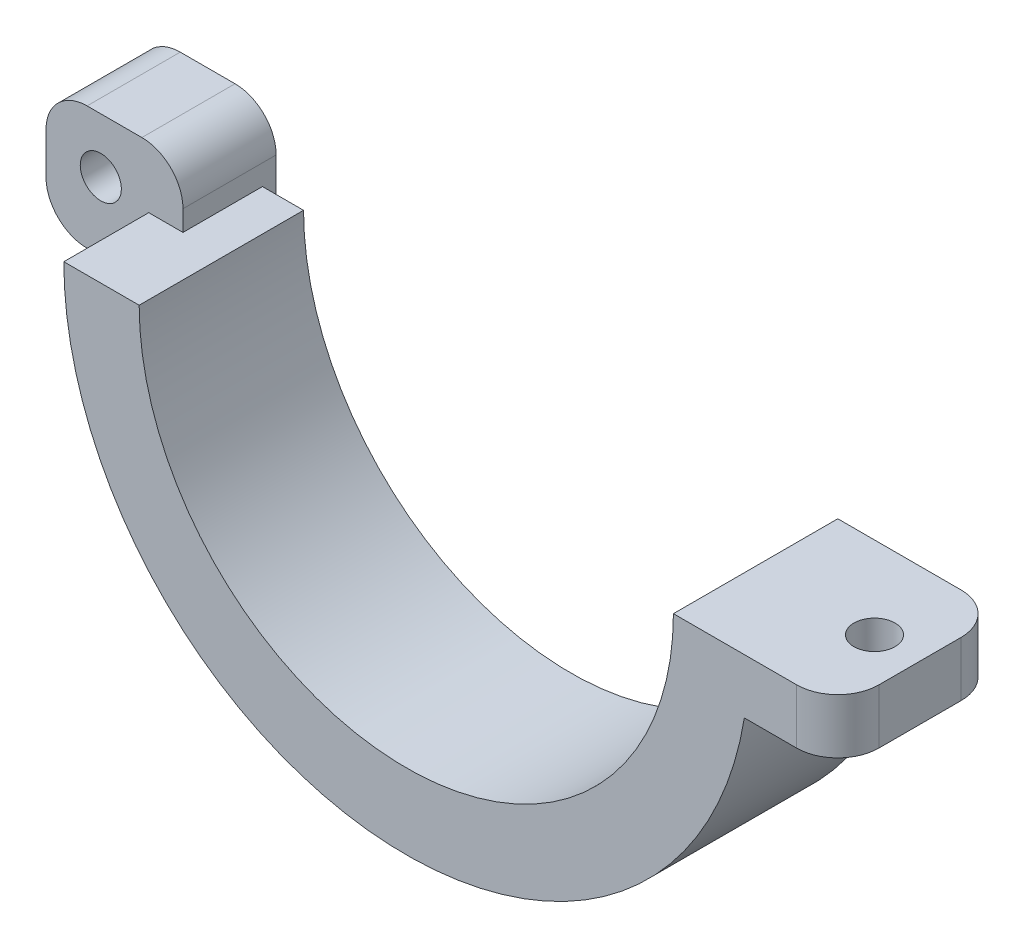
ISO-10303-21;
HEADER;
FILE_DESCRIPTION(('STEP AP214'),'2;1');
FILE_NAME('part.step','',(''),(''),'','','');
FILE_SCHEMA(('AUTOMOTIVE_DESIGN { 1 0 10303 214 1 1 1 1 }'));
ENDSEC;
DATA;
#1=APPLICATION_CONTEXT('core data for automotive mechanical design processes');
#2=APPLICATION_PROTOCOL_DEFINITION('international standard','automotive_design',2000,#1);
#3=PRODUCT_CONTEXT('',#1,'mechanical');
#4=PRODUCT('Part','Part','',(#3));
#5=PRODUCT_RELATED_PRODUCT_CATEGORY('part','',(#4));
#6=PRODUCT_DEFINITION_FORMATION('','',#4);
#7=PRODUCT_DEFINITION_CONTEXT('part definition',#1,'design');
#8=PRODUCT_DEFINITION('design','',#6,#7);
#9=PRODUCT_DEFINITION_SHAPE('','',#8);
#10=(LENGTH_UNIT() NAMED_UNIT(*) SI_UNIT(.MILLI.,.METRE.));
#11=(NAMED_UNIT(*) PLANE_ANGLE_UNIT() SI_UNIT($,.RADIAN.));
#12=(NAMED_UNIT(*) SI_UNIT($,.STERADIAN.) SOLID_ANGLE_UNIT());
#13=UNCERTAINTY_MEASURE_WITH_UNIT(LENGTH_MEASURE(1.E-05),#10,'distance_accuracy_value','');
#14=(GEOMETRIC_REPRESENTATION_CONTEXT(3) GLOBAL_UNCERTAINTY_ASSIGNED_CONTEXT((#13)) GLOBAL_UNIT_ASSIGNED_CONTEXT((#10,
#11,#12)) REPRESENTATION_CONTEXT('',''));
#15=CARTESIAN_POINT('',(0.,0.,0.));
#16=DIRECTION('',(0.,0.,1.));
#17=DIRECTION('',(1.,0.,0.));
#18=AXIS2_PLACEMENT_3D('',#15,#16,#17);
#19=CARTESIAN_POINT('',(28.5,0.,9.));
#20=DIRECTION('',(0.,1.,0.));
#21=DIRECTION('',(0.,0.,1.));
#22=AXIS2_PLACEMENT_3D('',#19,#20,#21);
#23=CYLINDRICAL_SURFACE('',#22,3.);
#24=DIRECTION('',(0.,1.,0.));
#25=VECTOR('',#24,1.);
#26=CARTESIAN_POINT('',(28.5,0.,12.));
#27=LINE('',#26,#25);
#28=CARTESIAN_POINT('',(28.5,-4.,12.));
#29=VERTEX_POINT('',#28);
#30=CARTESIAN_POINT('',(28.5,0.,12.));
#31=VERTEX_POINT('',#30);
#32=EDGE_CURVE('E281',#29,#31,#27,.T.);
#33=ORIENTED_EDGE('',*,*,#32,.F.);
#34=CARTESIAN_POINT('',(28.5,-4.,9.));
#35=DIRECTION('',(0.,-1.,0.));
#36=DIRECTION('',(0.,0.,-1.));
#37=AXIS2_PLACEMENT_3D('',#34,#35,#36);
#38=CIRCLE('',#37,3.);
#39=CARTESIAN_POINT('',(31.5,-4.,9.));
#40=VERTEX_POINT('',#39);
#41=EDGE_CURVE('E41',#40,#29,#38,.T.);
#42=ORIENTED_EDGE('',*,*,#41,.F.);
#43=DIRECTION('',(0.,1.,0.));
#44=VECTOR('',#43,1.);
#45=CARTESIAN_POINT('',(31.5,0.,9.));
#46=LINE('',#45,#44);
#47=CARTESIAN_POINT('',(31.5,0.,9.));
#48=VERTEX_POINT('',#47);
#49=EDGE_CURVE('E284',#48,#40,#46,.F.);
#50=ORIENTED_EDGE('',*,*,#49,.F.);
#51=CARTESIAN_POINT('',(28.5,0.,9.));
#52=DIRECTION('',(0.,1.,0.));
#53=DIRECTION('',(0.,0.,1.));
#54=AXIS2_PLACEMENT_3D('',#51,#52,#53);
#55=CIRCLE('',#54,3.);
#56=EDGE_CURVE('E11',#31,#48,#55,.T.);
#57=ORIENTED_EDGE('',*,*,#56,.F.);
#58=EDGE_LOOP('',(#33,#42,#50,#57));
#59=FACE_BOUND('',#58,.T.);
#60=ADVANCED_FACE('F34',(#59),#23,.T.);
#61=CARTESIAN_POINT('',(28.5,0.,3.));
#62=DIRECTION('',(0.,1.,0.));
#63=DIRECTION('',(0.,0.,1.));
#64=AXIS2_PLACEMENT_3D('',#61,#62,#63);
#65=CYLINDRICAL_SURFACE('',#64,3.);
#66=DIRECTION('',(0.,-1.,0.));
#67=VECTOR('',#66,1.);
#68=CARTESIAN_POINT('',(28.5,0.,0.));
#69=LINE('',#68,#67);
#70=CARTESIAN_POINT('',(28.5,0.,0.));
#71=VERTEX_POINT('',#70);
#72=CARTESIAN_POINT('',(28.5,-4.,0.));
#73=VERTEX_POINT('',#72);
#74=EDGE_CURVE('E270',#71,#73,#69,.T.);
#75=ORIENTED_EDGE('',*,*,#74,.F.);
#76=CARTESIAN_POINT('',(28.5,0.,3.));
#77=DIRECTION('',(0.,1.,0.));
#78=DIRECTION('',(0.,0.,1.));
#79=AXIS2_PLACEMENT_3D('',#76,#77,#78);
#80=CIRCLE('',#79,3.);
#81=CARTESIAN_POINT('',(31.5,0.,3.));
#82=VERTEX_POINT('',#81);
#83=EDGE_CURVE('E276',#82,#71,#80,.T.);
#84=ORIENTED_EDGE('',*,*,#83,.F.);
#85=DIRECTION('',(0.,-1.,0.));
#86=VECTOR('',#85,1.);
#87=CARTESIAN_POINT('',(31.5,0.,3.));
#88=LINE('',#87,#86);
#89=CARTESIAN_POINT('',(31.5,-4.,3.));
#90=VERTEX_POINT('',#89);
#91=EDGE_CURVE('E273',#90,#82,#88,.F.);
#92=ORIENTED_EDGE('',*,*,#91,.F.);
#93=CARTESIAN_POINT('',(28.5,-4.,3.));
#94=DIRECTION('',(0.,-1.,0.));
#95=DIRECTION('',(0.,0.,-1.));
#96=AXIS2_PLACEMENT_3D('',#93,#94,#95);
#97=CIRCLE('',#96,3.);
#98=EDGE_CURVE('E278',#73,#90,#97,.T.);
#99=ORIENTED_EDGE('',*,*,#98,.F.);
#100=EDGE_LOOP('',(#75,#84,#92,#99));
#101=FACE_BOUND('',#100,.T.);
#102=ADVANCED_FACE('F309',(#101),#65,.T.);
#103=CARTESIAN_POINT('',(-25.5,1.5,-1.));
#104=DIRECTION('',(0.,0.,-1.));
#105=DIRECTION('',(-1.,0.,0.));
#106=AXIS2_PLACEMENT_3D('',#103,#104,#105);
#107=CYLINDRICAL_SURFACE('',#106,3.);
#108=DIRECTION('',(0.,0.,-1.));
#109=VECTOR('',#108,1.);
#110=CARTESIAN_POINT('',(-25.5,4.5,-1.));
#111=LINE('',#110,#109);
#112=CARTESIAN_POINT('',(-25.5,4.5,5.8));
#113=VERTEX_POINT('',#112);
#114=CARTESIAN_POINT('',(-25.5,4.5,-1.));
#115=VERTEX_POINT('',#114);
#116=EDGE_CURVE('E262',#113,#115,#111,.T.);
#117=ORIENTED_EDGE('',*,*,#116,.F.);
#118=CARTESIAN_POINT('',(-25.5,1.5,5.8));
#119=DIRECTION('',(0.,0.,1.));
#120=DIRECTION('',(1.,0.,0.));
#121=AXIS2_PLACEMENT_3D('',#118,#119,#120);
#122=CIRCLE('',#121,3.);
#123=CARTESIAN_POINT('',(-22.5,1.5,5.8));
#124=VERTEX_POINT('',#123);
#125=EDGE_CURVE('E267',#124,#113,#122,.T.);
#126=ORIENTED_EDGE('',*,*,#125,.F.);
#127=DIRECTION('',(0.,0.,-1.));
#128=VECTOR('',#127,1.);
#129=CARTESIAN_POINT('',(-22.5,1.5,-1.));
#130=LINE('',#129,#128);
#131=CARTESIAN_POINT('',(-22.5,1.5,-1.));
#132=VERTEX_POINT('',#131);
#133=EDGE_CURVE('E265',#132,#124,#130,.F.);
#134=ORIENTED_EDGE('',*,*,#133,.F.);
#135=CARTESIAN_POINT('',(-25.5,1.5,-1.));
#136=DIRECTION('',(0.,0.,1.));
#137=DIRECTION('',(1.,0.,0.));
#138=AXIS2_PLACEMENT_3D('',#135,#136,#137);
#139=CIRCLE('',#138,3.);
#140=EDGE_CURVE('E154',#115,#132,#139,.F.);
#141=ORIENTED_EDGE('',*,*,#140,.F.);
#142=EDGE_LOOP('',(#117,#126,#134,#141));
#143=FACE_BOUND('',#142,.T.);
#144=ADVANCED_FACE('F349',(#143),#107,.T.);
#145=CARTESIAN_POINT('',(-29.5,1.5,-1.));
#146=DIRECTION('',(0.,0.,1.));
#147=DIRECTION('',(1.,0.,0.));
#148=AXIS2_PLACEMENT_3D('',#145,#146,#147);
#149=CYLINDRICAL_SURFACE('',#148,3.);
#150=DIRECTION('',(0.,0.,1.));
#151=VECTOR('',#150,1.);
#152=CARTESIAN_POINT('',(-29.5,4.5,-1.));
#153=LINE('',#152,#151);
#154=CARTESIAN_POINT('',(-29.5,4.5,-1.));
#155=VERTEX_POINT('',#154);
#156=CARTESIAN_POINT('',(-29.5,4.5,5.8));
#157=VERTEX_POINT('',#156);
#158=EDGE_CURVE('E252',#155,#157,#153,.T.);
#159=ORIENTED_EDGE('',*,*,#158,.F.);
#160=CARTESIAN_POINT('',(-29.5,1.5,-1.));
#161=DIRECTION('',(0.,0.,1.));
#162=DIRECTION('',(1.,0.,0.));
#163=AXIS2_PLACEMENT_3D('',#160,#161,#162);
#164=CIRCLE('',#163,3.);
#165=CARTESIAN_POINT('',(-32.5,1.5,-1.));
#166=VERTEX_POINT('',#165);
#167=EDGE_CURVE('E258',#166,#155,#164,.F.);
#168=ORIENTED_EDGE('',*,*,#167,.F.);
#169=DIRECTION('',(0.,0.,1.));
#170=VECTOR('',#169,1.);
#171=CARTESIAN_POINT('',(-32.5,1.5,-1.));
#172=LINE('',#171,#170);
#173=CARTESIAN_POINT('',(-32.5,1.5,5.8));
#174=VERTEX_POINT('',#173);
#175=EDGE_CURVE('E255',#174,#166,#172,.F.);
#176=ORIENTED_EDGE('',*,*,#175,.F.);
#177=CARTESIAN_POINT('',(-29.5,1.5,5.8));
#178=DIRECTION('',(0.,0.,1.));
#179=DIRECTION('',(1.,0.,0.));
#180=AXIS2_PLACEMENT_3D('',#177,#178,#179);
#181=CIRCLE('',#180,3.);
#182=EDGE_CURVE('E260',#157,#174,#181,.T.);
#183=ORIENTED_EDGE('',*,*,#182,.F.);
#184=EDGE_LOOP('',(#159,#168,#176,#183));
#185=FACE_BOUND('',#184,.T.);
#186=ADVANCED_FACE('F342',(#185),#149,.T.);
#187=CARTESIAN_POINT('',(-29.5,-1.5,-1.));
#188=DIRECTION('',(0.,0.,-1.));
#189=DIRECTION('',(-1.,0.,0.));
#190=AXIS2_PLACEMENT_3D('',#187,#188,#189);
#191=CYLINDRICAL_SURFACE('',#190,3.);
#192=DIRECTION('',(0.,0.,-1.));
#193=VECTOR('',#192,1.);
#194=CARTESIAN_POINT('',(-29.5,-4.5,-1.));
#195=LINE('',#194,#193);
#196=CARTESIAN_POINT('',(-29.5,-4.5,5.8));
#197=VERTEX_POINT('',#196);
#198=CARTESIAN_POINT('',(-29.5,-4.5,-1.));
#199=VERTEX_POINT('',#198);
#200=EDGE_CURVE('E169',#197,#199,#195,.T.);
#201=ORIENTED_EDGE('',*,*,#200,.F.);
#202=CARTESIAN_POINT('',(-29.5,-1.5,5.8));
#203=DIRECTION('',(0.,0.,1.));
#204=DIRECTION('',(1.,0.,0.));
#205=AXIS2_PLACEMENT_3D('',#202,#203,#204);
#206=CIRCLE('',#205,3.);
#207=CARTESIAN_POINT('',(-32.5,-1.5,5.8));
#208=VERTEX_POINT('',#207);
#209=EDGE_CURVE('E248',#208,#197,#206,.T.);
#210=ORIENTED_EDGE('',*,*,#209,.F.);
#211=DIRECTION('',(0.,0.,-1.));
#212=VECTOR('',#211,1.);
#213=CARTESIAN_POINT('',(-32.5,-1.5,-1.));
#214=LINE('',#213,#212);
#215=CARTESIAN_POINT('',(-32.5,-1.5,-1.));
#216=VERTEX_POINT('',#215);
#217=EDGE_CURVE('E245',#216,#208,#214,.F.);
#218=ORIENTED_EDGE('',*,*,#217,.F.);
#219=CARTESIAN_POINT('',(-29.5,-1.5,-1.));
#220=DIRECTION('',(0.,0.,1.));
#221=DIRECTION('',(1.,0.,0.));
#222=AXIS2_PLACEMENT_3D('',#219,#220,#221);
#223=CIRCLE('',#222,3.);
#224=EDGE_CURVE('E250',#199,#216,#223,.F.);
#225=ORIENTED_EDGE('',*,*,#224,.F.);
#226=EDGE_LOOP('',(#201,#210,#218,#225));
#227=FACE_BOUND('',#226,.T.);
#228=ADVANCED_FACE('F351',(#227),#191,.T.);
#229=CARTESIAN_POINT('',(0.,0.,12.));
#230=DIRECTION('',(0.,1.,0.));
#231=DIRECTION('',(0.,0.,1.));
#232=AXIS2_PLACEMENT_3D('',#229,#230,#231);
#233=PLANE('',#232);
#234=DIRECTION('',(1.,0.,0.));
#235=VECTOR('',#234,1.);
#236=CARTESIAN_POINT('',(0.,0.,0.));
#237=LINE('',#236,#235);
#238=CARTESIAN_POINT('',(-22.5,0.,0.));
#239=VERTEX_POINT('',#238);
#240=CARTESIAN_POINT('',(-19.5,0.,0.));
#241=VERTEX_POINT('',#240);
#242=EDGE_CURVE('E207',#239,#241,#237,.T.);
#243=ORIENTED_EDGE('',*,*,#242,.F.);
#244=DIRECTION('',(0.,0.,1.));
#245=VECTOR('',#244,1.);
#246=CARTESIAN_POINT('',(-22.5,0.,12.));
#247=LINE('',#246,#245);
#248=CARTESIAN_POINT('',(-22.5,0.,5.8));
#249=VERTEX_POINT('',#248);
#250=EDGE_CURVE('E180',#239,#249,#247,.T.);
#251=ORIENTED_EDGE('',*,*,#250,.T.);
#252=DIRECTION('',(1.,0.,0.));
#253=VECTOR('',#252,1.);
#254=CARTESIAN_POINT('',(0.,0.,5.8));
#255=LINE('',#254,#253);
#256=CARTESIAN_POINT('',(-25.,0.,5.8));
#257=VERTEX_POINT('',#256);
#258=EDGE_CURVE('E187',#257,#249,#255,.T.);
#259=ORIENTED_EDGE('',*,*,#258,.F.);
#260=DIRECTION('',(0.,0.,-1.));
#261=VECTOR('',#260,1.);
#262=CARTESIAN_POINT('',(-25.,0.,12.));
#263=LINE('',#262,#261);
#264=CARTESIAN_POINT('',(-25.,0.,12.));
#265=VERTEX_POINT('',#264);
#266=EDGE_CURVE('E231',#265,#257,#263,.T.);
#267=ORIENTED_EDGE('',*,*,#266,.F.);
#268=DIRECTION('',(1.,0.,0.));
#269=VECTOR('',#268,1.);
#270=CARTESIAN_POINT('',(0.,0.,12.));
#271=LINE('',#270,#269);
#272=CARTESIAN_POINT('',(-19.5,0.,12.));
#273=VERTEX_POINT('',#272);
#274=EDGE_CURVE('E208',#265,#273,#271,.T.);
#275=ORIENTED_EDGE('',*,*,#274,.T.);
#276=DIRECTION('',(0.,0.,-1.));
#277=VECTOR('',#276,1.);
#278=CARTESIAN_POINT('',(-19.5,0.,12.));
#279=LINE('',#278,#277);
#280=EDGE_CURVE('E219',#273,#241,#279,.T.);
#281=ORIENTED_EDGE('',*,*,#280,.T.);
#282=EDGE_LOOP('',(#243,#251,#259,#267,#275,#281));
#283=FACE_BOUND('',#282,.T.);
#284=ADVANCED_FACE('F319',(#283),#233,.T.);
#285=CARTESIAN_POINT('',(0.,0.,12.));
#286=DIRECTION('',(0.,0.,-1.));
#287=DIRECTION('',(-1.,0.,0.));
#288=AXIS2_PLACEMENT_3D('',#285,#286,#287);
#289=CYLINDRICAL_SURFACE('',#288,25.);
#290=DIRECTION('',(0.,0.,-1.));
#291=VECTOR('',#290,1.);
#292=CARTESIAN_POINT('',(-24.5916652547159,-4.5,12.));
#293=LINE('',#292,#291);
#294=CARTESIAN_POINT('',(-24.5916652547159,-4.5,0.));
#295=VERTEX_POINT('',#294);
#296=CARTESIAN_POINT('',(-24.5916652547159,-4.5,5.8));
#297=VERTEX_POINT('',#296);
#298=EDGE_CURVE('E176',#295,#297,#293,.F.);
#299=ORIENTED_EDGE('',*,*,#298,.F.);
#300=CARTESIAN_POINT('',(0.,0.,0.));
#301=DIRECTION('',(0.,0.,1.));
#302=DIRECTION('',(1.,0.,0.));
#303=AXIS2_PLACEMENT_3D('',#300,#301,#302);
#304=CIRCLE('',#303,25.);
#305=CARTESIAN_POINT('',(24.6779253585061,-4.,0.));
#306=VERTEX_POINT('',#305);
#307=EDGE_CURVE('E221',#295,#306,#304,.T.);
#308=ORIENTED_EDGE('',*,*,#307,.T.);
#309=DIRECTION('',(0.,0.,-1.));
#310=VECTOR('',#309,1.);
#311=CARTESIAN_POINT('',(24.6779253585061,-4.,12.));
#312=LINE('',#311,#310);
#313=CARTESIAN_POINT('',(24.6779253585061,-4.,12.));
#314=VERTEX_POINT('',#313);
#315=EDGE_CURVE('E203',#306,#314,#312,.F.);
#316=ORIENTED_EDGE('',*,*,#315,.T.);
#317=CARTESIAN_POINT('',(0.,0.,12.));
#318=DIRECTION('',(0.,0.,1.));
#319=DIRECTION('',(1.,0.,0.));
#320=AXIS2_PLACEMENT_3D('',#317,#318,#319);
#321=CIRCLE('',#320,25.);
#322=EDGE_CURVE('E211',#265,#314,#321,.T.);
#323=ORIENTED_EDGE('',*,*,#322,.F.);
#324=ORIENTED_EDGE('',*,*,#266,.T.);
#325=CARTESIAN_POINT('',(0.,0.,5.8));
#326=DIRECTION('',(0.,0.,1.));
#327=DIRECTION('',(1.,0.,0.));
#328=AXIS2_PLACEMENT_3D('',#325,#326,#327);
#329=CIRCLE('',#328,25.);
#330=EDGE_CURVE('E237',#257,#297,#329,.T.);
#331=ORIENTED_EDGE('',*,*,#330,.T.);
#332=EDGE_LOOP('',(#299,#308,#316,#323,#324,#331));
#333=FACE_BOUND('',#332,.T.);
#334=ADVANCED_FACE('F298',(#333),#289,.T.);
#335=CARTESIAN_POINT('',(0.,0.,0.));
#336=DIRECTION('',(0.,0.,1.));
#337=DIRECTION('',(1.,0.,0.));
#338=AXIS2_PLACEMENT_3D('',#335,#336,#337);
#339=PLANE('',#338);
#340=CARTESIAN_POINT('',(19.5,0.,0.));
#341=VERTEX_POINT('',#340);
#342=EDGE_CURVE('E222',#341,#71,#237,.T.);
#343=ORIENTED_EDGE('',*,*,#342,.T.);
#344=ORIENTED_EDGE('',*,*,#74,.T.);
#345=DIRECTION('',(-1.,0.,0.));
#346=VECTOR('',#345,1.);
#347=CARTESIAN_POINT('',(31.5,-4.,0.));
#348=LINE('',#347,#346);
#349=EDGE_CURVE('E196',#73,#306,#348,.T.);
#350=ORIENTED_EDGE('',*,*,#349,.T.);
#351=ORIENTED_EDGE('',*,*,#307,.F.);
#352=DIRECTION('',(-1.,0.,0.));
#353=VECTOR('',#352,1.);
#354=CARTESIAN_POINT('',(0.,-4.5,0.));
#355=LINE('',#354,#353);
#356=CARTESIAN_POINT('',(-22.5,-4.5,0.));
#357=VERTEX_POINT('',#356);
#358=EDGE_CURVE('E234',#357,#295,#355,.T.);
#359=ORIENTED_EDGE('',*,*,#358,.F.);
#360=DIRECTION('',(0.,-1.,0.));
#361=VECTOR('',#360,1.);
#362=CARTESIAN_POINT('',(-22.5,0.,0.));
#363=LINE('',#362,#361);
#364=EDGE_CURVE('E175',#239,#357,#363,.T.);
#365=ORIENTED_EDGE('',*,*,#364,.F.);
#366=ORIENTED_EDGE('',*,*,#242,.T.);
#367=CARTESIAN_POINT('',(0.,0.,0.));
#368=DIRECTION('',(0.,0.,1.));
#369=DIRECTION('',(1.,0.,0.));
#370=AXIS2_PLACEMENT_3D('',#367,#368,#369);
#371=CIRCLE('',#370,19.5);
#372=EDGE_CURVE('E212',#241,#341,#371,.T.);
#373=ORIENTED_EDGE('',*,*,#372,.T.);
#374=EDGE_LOOP('',(#343,#344,#350,#351,#359,#365,#366,#373));
#375=FACE_BOUND('',#374,.T.);
#376=ADVANCED_FACE('F304',(#375),#339,.F.);
#377=CARTESIAN_POINT('',(28.1779253585061,0.,6.));
#378=DIRECTION('',(0.,1.,0.));
#379=DIRECTION('',(0.,0.,1.));
#380=AXIS2_PLACEMENT_3D('',#377,#378,#379);
#381=CIRCLE('',#380,1.49999999999885);
#382=CARTESIAN_POINT('',(28.1779253585061,0.,7.49999999999885));
#383=VERTEX_POINT('',#382);
#384=EDGE_CURVE('E193',#383,#383,#381,.T.);
#385=ORIENTED_EDGE('',*,*,#384,.F.);
#386=EDGE_LOOP('',(#385));
#387=FACE_BOUND('',#386,.T.);
#388=CARTESIAN_POINT('',(19.5,0.,12.));
#389=VERTEX_POINT('',#388);
#390=EDGE_CURVE('E213',#389,#31,#271,.T.);
#391=ORIENTED_EDGE('',*,*,#390,.T.);
#392=ORIENTED_EDGE('',*,*,#56,.T.);
#393=DIRECTION('',(0.,0.,-1.));
#394=VECTOR('',#393,1.);
#395=CARTESIAN_POINT('',(31.5,0.,12.));
#396=LINE('',#395,#394);
#397=EDGE_CURVE('E201',#48,#82,#396,.T.);
#398=ORIENTED_EDGE('',*,*,#397,.T.);
#399=ORIENTED_EDGE('',*,*,#83,.T.);
#400=ORIENTED_EDGE('',*,*,#342,.F.);
#401=DIRECTION('',(0.,0.,-1.));
#402=VECTOR('',#401,1.);
#403=CARTESIAN_POINT('',(19.5,0.,12.));
#404=LINE('',#403,#402);
#405=EDGE_CURVE('E229',#389,#341,#404,.T.);
#406=ORIENTED_EDGE('',*,*,#405,.F.);
#407=EDGE_LOOP('',(#391,#392,#398,#399,#400,#406));
#408=FACE_BOUND('',#407,.T.);
#409=ADVANCED_FACE('F313',(#387,#408),#233,.T.);
#410=CARTESIAN_POINT('',(0.,0.,12.));
#411=DIRECTION('',(0.,0.,-1.));
#412=DIRECTION('',(-1.,0.,0.));
#413=AXIS2_PLACEMENT_3D('',#410,#411,#412);
#414=CYLINDRICAL_SURFACE('',#413,19.5);
#415=ORIENTED_EDGE('',*,*,#372,.F.);
#416=ORIENTED_EDGE('',*,*,#280,.F.);
#417=CARTESIAN_POINT('',(0.,0.,12.));
#418=DIRECTION('',(0.,0.,1.));
#419=DIRECTION('',(1.,0.,0.));
#420=AXIS2_PLACEMENT_3D('',#417,#418,#419);
#421=CIRCLE('',#420,19.5);
#422=EDGE_CURVE('E216',#273,#389,#421,.T.);
#423=ORIENTED_EDGE('',*,*,#422,.T.);
#424=ORIENTED_EDGE('',*,*,#405,.T.);
#425=EDGE_LOOP('',(#415,#416,#423,#424));
#426=FACE_BOUND('',#425,.T.);
#427=ADVANCED_FACE('F317',(#426),#414,.F.);
#428=CARTESIAN_POINT('',(0.,0.,12.));
#429=DIRECTION('',(0.,0.,1.));
#430=DIRECTION('',(1.,0.,0.));
#431=AXIS2_PLACEMENT_3D('',#428,#429,#430);
#432=PLANE('',#431);
#433=DIRECTION('',(-1.,0.,0.));
#434=VECTOR('',#433,1.);
#435=CARTESIAN_POINT('',(31.5,-4.,12.));
#436=LINE('',#435,#434);
#437=EDGE_CURVE('E197',#29,#314,#436,.T.);
#438=ORIENTED_EDGE('',*,*,#437,.F.);
#439=ORIENTED_EDGE('',*,*,#32,.T.);
#440=ORIENTED_EDGE('',*,*,#390,.F.);
#441=ORIENTED_EDGE('',*,*,#422,.F.);
#442=ORIENTED_EDGE('',*,*,#274,.F.);
#443=ORIENTED_EDGE('',*,*,#322,.T.);
#444=EDGE_LOOP('',(#438,#439,#440,#441,#442,#443));
#445=FACE_BOUND('',#444,.T.);
#446=ADVANCED_FACE('F292',(#445),#432,.T.);
#447=CARTESIAN_POINT('',(31.5,-4.,12.));
#448=DIRECTION('',(0.,-1.,0.));
#449=DIRECTION('',(0.,0.,-1.));
#450=AXIS2_PLACEMENT_3D('',#447,#448,#449);
#451=PLANE('',#450);
#452=CARTESIAN_POINT('',(28.1779253585061,-4.,6.));
#453=DIRECTION('',(0.,-1.,0.));
#454=DIRECTION('',(0.,0.,-1.));
#455=AXIS2_PLACEMENT_3D('',#452,#453,#454);
#456=CIRCLE('',#455,1.49999999999885);
#457=CARTESIAN_POINT('',(28.1779253585061,-4.,4.50000000000115));
#458=VERTEX_POINT('',#457);
#459=EDGE_CURVE('E190',#458,#458,#456,.T.);
#460=ORIENTED_EDGE('',*,*,#459,.F.);
#461=EDGE_LOOP('',(#460));
#462=FACE_BOUND('',#461,.T.);
#463=DIRECTION('',(0.,0.,-1.));
#464=VECTOR('',#463,1.);
#465=CARTESIAN_POINT('',(31.5,-4.,12.));
#466=LINE('',#465,#464);
#467=EDGE_CURVE('E199',#40,#90,#466,.T.);
#468=ORIENTED_EDGE('',*,*,#467,.F.);
#469=ORIENTED_EDGE('',*,*,#41,.T.);
#470=ORIENTED_EDGE('',*,*,#437,.T.);
#471=ORIENTED_EDGE('',*,*,#315,.F.);
#472=ORIENTED_EDGE('',*,*,#349,.F.);
#473=ORIENTED_EDGE('',*,*,#98,.T.);
#474=EDGE_LOOP('',(#468,#469,#470,#471,#472,#473));
#475=FACE_BOUND('',#474,.T.);
#476=ADVANCED_FACE('F287',(#462,#475),#451,.T.);
#477=CARTESIAN_POINT('',(31.5,0.,12.));
#478=DIRECTION('',(1.,0.,0.));
#479=DIRECTION('',(0.,0.,-1.));
#480=AXIS2_PLACEMENT_3D('',#477,#478,#479);
#481=PLANE('',#480);
#482=ORIENTED_EDGE('',*,*,#397,.F.);
#483=ORIENTED_EDGE('',*,*,#49,.T.);
#484=ORIENTED_EDGE('',*,*,#467,.T.);
#485=ORIENTED_EDGE('',*,*,#91,.T.);
#486=EDGE_LOOP('',(#482,#483,#484,#485));
#487=FACE_BOUND('',#486,.T.);
#488=ADVANCED_FACE('F312',(#487),#481,.T.);
#489=CARTESIAN_POINT('',(28.1779253585061,8.,6.));
#490=DIRECTION('',(0.,-1.,0.));
#491=DIRECTION('',(0.,0.,-1.));
#492=AXIS2_PLACEMENT_3D('',#489,#490,#491);
#493=CYLINDRICAL_SURFACE('',#492,1.49999999999885);
#494=ORIENTED_EDGE('',*,*,#384,.T.);
#495=EDGE_LOOP('',(#494));
#496=FACE_BOUND('',#495,.T.);
#497=ORIENTED_EDGE('',*,*,#459,.T.);
#498=EDGE_LOOP('',(#497));
#499=FACE_BOUND('',#498,.T.);
#500=ADVANCED_FACE('F445',(#496,#499),#493,.F.);
#501=CARTESIAN_POINT('',(-22.5,-4.5,-1.));
#502=DIRECTION('',(0.,1.,0.));
#503=DIRECTION('',(0.,0.,1.));
#504=AXIS2_PLACEMENT_3D('',#501,#502,#503);
#505=PLANE('',#504);
#506=DIRECTION('',(-1.,0.,0.));
#507=VECTOR('',#506,1.);
#508=CARTESIAN_POINT('',(-22.5,-4.5,5.8));
#509=LINE('',#508,#507);
#510=EDGE_CURVE('E324',#297,#197,#509,.T.);
#511=ORIENTED_EDGE('',*,*,#510,.T.);
#512=ORIENTED_EDGE('',*,*,#200,.T.);
#513=DIRECTION('',(-1.,0.,0.));
#514=VECTOR('',#513,1.);
#515=CARTESIAN_POINT('',(-22.5,-4.5,-1.));
#516=LINE('',#515,#514);
#517=CARTESIAN_POINT('',(-22.5,-4.5,-1.));
#518=VERTEX_POINT('',#517);
#519=EDGE_CURVE('E153',#518,#199,#516,.T.);
#520=ORIENTED_EDGE('',*,*,#519,.F.);
#521=DIRECTION('',(0.,0.,1.));
#522=VECTOR('',#521,1.);
#523=CARTESIAN_POINT('',(-22.5,-4.5,-1.));
#524=LINE('',#523,#522);
#525=EDGE_CURVE('E167',#518,#357,#524,.T.);
#526=ORIENTED_EDGE('',*,*,#525,.T.);
#527=ORIENTED_EDGE('',*,*,#358,.T.);
#528=ORIENTED_EDGE('',*,*,#298,.T.);
#529=EDGE_LOOP('',(#511,#512,#520,#526,#527,#528));
#530=FACE_BOUND('',#529,.T.);
#531=ADVANCED_FACE('F165',(#530),#505,.F.);
#532=CARTESIAN_POINT('',(-22.5,-4.5,-1.));
#533=DIRECTION('',(-1.,0.,0.));
#534=DIRECTION('',(0.,0.,1.));
#535=AXIS2_PLACEMENT_3D('',#532,#533,#534);
#536=PLANE('',#535);
#537=DIRECTION('',(0.,-1.,0.));
#538=VECTOR('',#537,1.);
#539=CARTESIAN_POINT('',(-22.5,-4.5,-1.));
#540=LINE('',#539,#538);
#541=EDGE_CURVE('E149',#132,#518,#540,.T.);
#542=ORIENTED_EDGE('',*,*,#541,.F.);
#543=ORIENTED_EDGE('',*,*,#133,.T.);
#544=DIRECTION('',(0.,-1.,0.));
#545=VECTOR('',#544,1.);
#546=CARTESIAN_POINT('',(-22.5,-4.5,5.8));
#547=LINE('',#546,#545);
#548=EDGE_CURVE('E242',#124,#249,#547,.T.);
#549=ORIENTED_EDGE('',*,*,#548,.T.);
#550=ORIENTED_EDGE('',*,*,#250,.F.);
#551=ORIENTED_EDGE('',*,*,#364,.T.);
#552=ORIENTED_EDGE('',*,*,#525,.F.);
#553=EDGE_LOOP('',(#542,#543,#549,#550,#551,#552));
#554=FACE_BOUND('',#553,.T.);
#555=ADVANCED_FACE('F173',(#554),#536,.F.);
#556=CARTESIAN_POINT('',(-32.5,-4.5,-1.));
#557=DIRECTION('',(1.,0.,0.));
#558=DIRECTION('',(0.,0.,-1.));
#559=AXIS2_PLACEMENT_3D('',#556,#557,#558);
#560=PLANE('',#559);
#561=DIRECTION('',(0.,1.,0.));
#562=VECTOR('',#561,1.);
#563=CARTESIAN_POINT('',(-32.5,-4.5,5.8));
#564=LINE('',#563,#562);
#565=EDGE_CURVE('E326',#208,#174,#564,.T.);
#566=ORIENTED_EDGE('',*,*,#565,.T.);
#567=ORIENTED_EDGE('',*,*,#175,.T.);
#568=DIRECTION('',(0.,1.,0.));
#569=VECTOR('',#568,1.);
#570=CARTESIAN_POINT('',(-32.5,-4.5,-1.));
#571=LINE('',#570,#569);
#572=EDGE_CURVE('E170',#216,#166,#571,.T.);
#573=ORIENTED_EDGE('',*,*,#572,.F.);
#574=ORIENTED_EDGE('',*,*,#217,.T.);
#575=EDGE_LOOP('',(#566,#567,#573,#574));
#576=FACE_BOUND('',#575,.T.);
#577=ADVANCED_FACE('F338',(#576),#560,.F.);
#578=CARTESIAN_POINT('',(-22.5,4.5,-1.));
#579=DIRECTION('',(0.,-1.,0.));
#580=DIRECTION('',(0.,0.,-1.));
#581=AXIS2_PLACEMENT_3D('',#578,#579,#580);
#582=PLANE('',#581);
#583=DIRECTION('',(1.,0.,0.));
#584=VECTOR('',#583,1.);
#585=CARTESIAN_POINT('',(-22.5,4.5,5.8));
#586=LINE('',#585,#584);
#587=EDGE_CURVE('E159',#157,#113,#586,.T.);
#588=ORIENTED_EDGE('',*,*,#587,.T.);
#589=ORIENTED_EDGE('',*,*,#116,.T.);
#590=DIRECTION('',(1.,0.,0.));
#591=VECTOR('',#590,1.);
#592=CARTESIAN_POINT('',(-22.5,4.5,-1.));
#593=LINE('',#592,#591);
#594=EDGE_CURVE('E177',#155,#115,#593,.T.);
#595=ORIENTED_EDGE('',*,*,#594,.F.);
#596=ORIENTED_EDGE('',*,*,#158,.T.);
#597=EDGE_LOOP('',(#588,#589,#595,#596));
#598=FACE_BOUND('',#597,.T.);
#599=ADVANCED_FACE('F346',(#598),#582,.F.);
#600=CARTESIAN_POINT('',(0.,0.,-1.));
#601=DIRECTION('',(0.,0.,1.));
#602=DIRECTION('',(1.,0.,0.));
#603=AXIS2_PLACEMENT_3D('',#600,#601,#602);
#604=PLANE('',#603);
#605=CARTESIAN_POINT('',(-28.5,0.5,-1.));
#606=DIRECTION('',(0.,0.,-1.));
#607=DIRECTION('',(-1.,0.,0.));
#608=AXIS2_PLACEMENT_3D('',#605,#606,#607);
#609=CIRCLE('',#608,1.5);
#610=CARTESIAN_POINT('',(-30.,0.5,-1.));
#611=VERTEX_POINT('',#610);
#612=EDGE_CURVE('E243',#611,#611,#609,.T.);
#613=ORIENTED_EDGE('',*,*,#612,.F.);
#614=EDGE_LOOP('',(#613));
#615=FACE_BOUND('',#614,.T.);
#616=ORIENTED_EDGE('',*,*,#594,.T.);
#617=ORIENTED_EDGE('',*,*,#140,.T.);
#618=ORIENTED_EDGE('',*,*,#541,.T.);
#619=ORIENTED_EDGE('',*,*,#519,.T.);
#620=ORIENTED_EDGE('',*,*,#224,.T.);
#621=ORIENTED_EDGE('',*,*,#572,.T.);
#622=ORIENTED_EDGE('',*,*,#167,.T.);
#623=EDGE_LOOP('',(#616,#617,#618,#619,#620,#621,#622));
#624=FACE_BOUND('',#623,.T.);
#625=ADVANCED_FACE('F152',(#615,#624),#604,.F.);
#626=CARTESIAN_POINT('',(0.,0.,5.8));
#627=DIRECTION('',(0.,0.,1.));
#628=DIRECTION('',(1.,0.,0.));
#629=AXIS2_PLACEMENT_3D('',#626,#627,#628);
#630=PLANE('',#629);
#631=CARTESIAN_POINT('',(-28.5,0.5,5.8));
#632=DIRECTION('',(0.,0.,1.));
#633=DIRECTION('',(1.,0.,0.));
#634=AXIS2_PLACEMENT_3D('',#631,#632,#633);
#635=CIRCLE('',#634,1.5);
#636=CARTESIAN_POINT('',(-27.,0.5,5.8));
#637=VERTEX_POINT('',#636);
#638=EDGE_CURVE('E239',#637,#637,#635,.T.);
#639=ORIENTED_EDGE('',*,*,#638,.F.);
#640=EDGE_LOOP('',(#639));
#641=FACE_BOUND('',#640,.T.);
#642=ORIENTED_EDGE('',*,*,#548,.F.);
#643=ORIENTED_EDGE('',*,*,#125,.T.);
#644=ORIENTED_EDGE('',*,*,#587,.F.);
#645=ORIENTED_EDGE('',*,*,#182,.T.);
#646=ORIENTED_EDGE('',*,*,#565,.F.);
#647=ORIENTED_EDGE('',*,*,#209,.T.);
#648=ORIENTED_EDGE('',*,*,#510,.F.);
#649=ORIENTED_EDGE('',*,*,#330,.F.);
#650=ORIENTED_EDGE('',*,*,#258,.T.);
#651=EDGE_LOOP('',(#642,#643,#644,#645,#646,#647,#648,#649,#650));
#652=FACE_BOUND('',#651,.T.);
#653=ADVANCED_FACE('F322',(#641,#652),#630,.T.);
#654=CARTESIAN_POINT('',(-28.5,0.5,9.));
#655=DIRECTION('',(0.,0.,-1.));
#656=DIRECTION('',(-1.,0.,0.));
#657=AXIS2_PLACEMENT_3D('',#654,#655,#656);
#658=CYLINDRICAL_SURFACE('',#657,1.5);
#659=ORIENTED_EDGE('',*,*,#638,.T.);
#660=EDGE_LOOP('',(#659));
#661=FACE_BOUND('',#660,.T.);
#662=ORIENTED_EDGE('',*,*,#612,.T.);
#663=EDGE_LOOP('',(#662));
#664=FACE_BOUND('',#663,.T.);
#665=ADVANCED_FACE('F413',(#661,#664),#658,.F.);
#666=CLOSED_SHELL('',(#60,#102,#144,#186,#228,#284,#334,#376,#409,#427,#446,#476,#488,#500,#531,
#555,#577,#599,#625,#653,#665));
#667=MANIFOLD_SOLID_BREP('B2',#666);
#668=ADVANCED_BREP_SHAPE_REPRESENTATION('',(#18,#667),#14);
#669=SHAPE_DEFINITION_REPRESENTATION(#9,#668);
ENDSEC;
END-ISO-10303-21;
